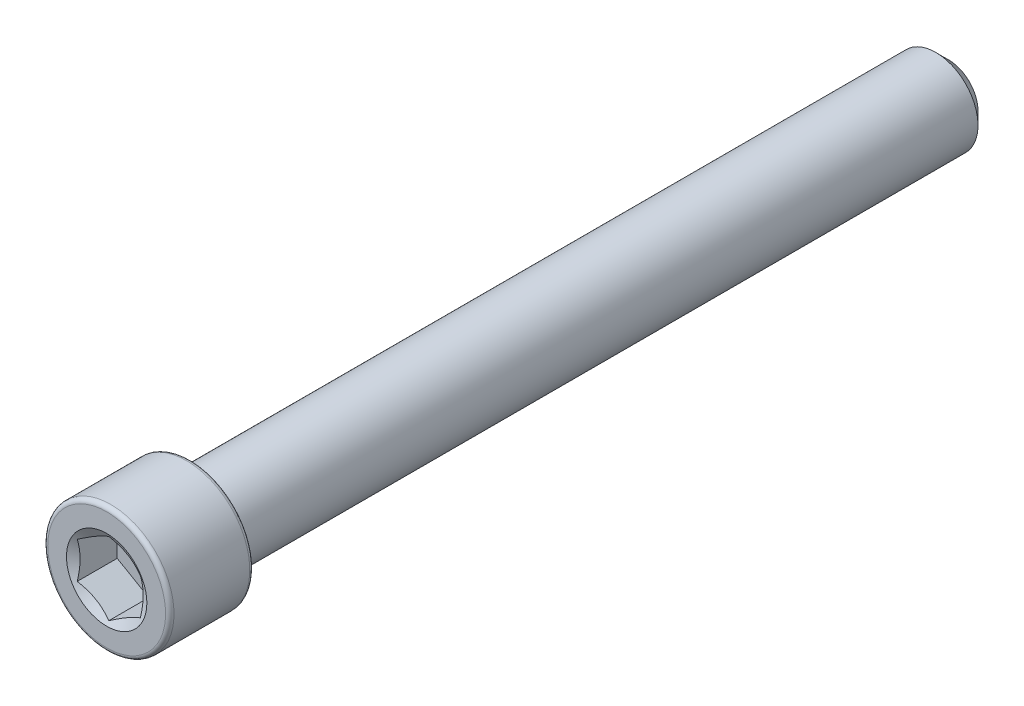
ISO-10303-21;
HEADER;
FILE_DESCRIPTION(('STEP AP214'),'2;1');
FILE_NAME('part.step','',(''),(''),'','','');
FILE_SCHEMA(('AUTOMOTIVE_DESIGN { 1 0 10303 214 1 1 1 1 }'));
ENDSEC;
DATA;
#1=APPLICATION_CONTEXT('core data for automotive mechanical design processes');
#2=APPLICATION_PROTOCOL_DEFINITION('international standard','automotive_design',2000,#1);
#3=PRODUCT_CONTEXT('',#1,'mechanical');
#4=PRODUCT('Part','Part','',(#3));
#5=PRODUCT_RELATED_PRODUCT_CATEGORY('part','',(#4));
#6=PRODUCT_DEFINITION_FORMATION('','',#4);
#7=PRODUCT_DEFINITION_CONTEXT('part definition',#1,'design');
#8=PRODUCT_DEFINITION('design','',#6,#7);
#9=PRODUCT_DEFINITION_SHAPE('','',#8);
#10=(LENGTH_UNIT() NAMED_UNIT(*) SI_UNIT(.MILLI.,.METRE.));
#11=(NAMED_UNIT(*) PLANE_ANGLE_UNIT() SI_UNIT($,.RADIAN.));
#12=(NAMED_UNIT(*) SI_UNIT($,.STERADIAN.) SOLID_ANGLE_UNIT());
#13=UNCERTAINTY_MEASURE_WITH_UNIT(LENGTH_MEASURE(1.E-05),#10,'distance_accuracy_value','');
#14=(GEOMETRIC_REPRESENTATION_CONTEXT(3) GLOBAL_UNCERTAINTY_ASSIGNED_CONTEXT((#13)) GLOBAL_UNIT_ASSIGNED_CONTEXT((#10,
#11,#12)) REPRESENTATION_CONTEXT('',''));
#15=CARTESIAN_POINT('',(0.,0.,0.));
#16=DIRECTION('',(0.,0.,1.));
#17=DIRECTION('',(1.,0.,0.));
#18=AXIS2_PLACEMENT_3D('',#15,#16,#17);
#19=CARTESIAN_POINT('',(0.,0.,-31.75));
#20=DIRECTION('',(0.,0.,-1.));
#21=DIRECTION('',(-1.,0.,0.));
#22=AXIS2_PLACEMENT_3D('',#19,#20,#21);
#23=PLANE('',#22);
#24=CARTESIAN_POINT('',(0.,0.,-31.75));
#25=DIRECTION('',(0.,0.,-1.));
#26=DIRECTION('',(-1.,0.,0.));
#27=AXIS2_PLACEMENT_3D('',#24,#25,#26);
#28=CIRCLE('',#27,2.22250000000002);
#29=CARTESIAN_POINT('',(-2.22250000000002,0.,-31.75));
#30=VERTEX_POINT('',#29);
#31=EDGE_CURVE('E48',#30,#30,#28,.T.);
#32=ORIENTED_EDGE('',*,*,#31,.T.);
#33=EDGE_LOOP('',(#32));
#34=FACE_BOUND('',#33,.T.);
#35=ADVANCED_FACE('F35',(#34),#23,.T.);
#36=CARTESIAN_POINT('',(0.,0.,-31.75));
#37=DIRECTION('',(0.,0.,1.));
#38=DIRECTION('',(1.,0.,0.));
#39=AXIS2_PLACEMENT_3D('',#36,#37,#38);
#40=CONICAL_SURFACE('',#39,2.22250000000002,0.785398163397449);
#41=CARTESIAN_POINT('',(0.,0.,-30.7975));
#42=DIRECTION('',(0.,0.,-1.));
#43=DIRECTION('',(-1.,0.,0.));
#44=AXIS2_PLACEMENT_3D('',#41,#42,#43);
#45=CIRCLE('',#44,3.17500000000002);
#46=CARTESIAN_POINT('',(-3.17500000000002,0.,-30.7975));
#47=VERTEX_POINT('',#46);
#48=EDGE_CURVE('E133',#47,#47,#45,.T.);
#49=ORIENTED_EDGE('',*,*,#48,.T.);
#50=EDGE_LOOP('',(#49));
#51=FACE_BOUND('',#50,.T.);
#52=ORIENTED_EDGE('',*,*,#31,.F.);
#53=EDGE_LOOP('',(#52));
#54=FACE_BOUND('',#53,.T.);
#55=ADVANCED_FACE('F139',(#51,#54),#40,.T.);
#56=CARTESIAN_POINT('',(0.,0.,-31.75));
#57=DIRECTION('',(0.,0.,-1.));
#58=DIRECTION('',(-1.,0.,0.));
#59=AXIS2_PLACEMENT_3D('',#56,#57,#58);
#60=CYLINDRICAL_SURFACE('',#59,3.17500000000002);
#61=CARTESIAN_POINT('',(0.,0.,25.4));
#62=DIRECTION('',(0.,0.,-1.));
#63=DIRECTION('',(-1.,0.,0.));
#64=AXIS2_PLACEMENT_3D('',#61,#62,#63);
#65=CIRCLE('',#64,3.17500000000002);
#66=CARTESIAN_POINT('',(-3.17500000000002,0.,25.4));
#67=VERTEX_POINT('',#66);
#68=EDGE_CURVE('E130',#67,#67,#65,.T.);
#69=ORIENTED_EDGE('',*,*,#68,.T.);
#70=EDGE_LOOP('',(#69));
#71=FACE_BOUND('',#70,.T.);
#72=ORIENTED_EDGE('',*,*,#48,.F.);
#73=EDGE_LOOP('',(#72));
#74=FACE_BOUND('',#73,.T.);
#75=ADVANCED_FACE('F141',(#71,#74),#60,.T.);
#76=CARTESIAN_POINT('',(0.,3.175,25.4));
#77=DIRECTION('',(0.,0.,-1.));
#78=DIRECTION('',(-1.,0.,0.));
#79=AXIS2_PLACEMENT_3D('',#76,#77,#78);
#80=PLANE('',#79);
#81=CARTESIAN_POINT('',(0.,0.,25.4));
#82=DIRECTION('',(0.,0.,-1.));
#83=DIRECTION('',(-1.,0.,0.));
#84=AXIS2_PLACEMENT_3D('',#81,#82,#83);
#85=CIRCLE('',#84,4.445);
#86=CARTESIAN_POINT('',(-4.445,0.,25.4));
#87=VERTEX_POINT('',#86);
#88=EDGE_CURVE('E127',#87,#87,#85,.T.);
#89=ORIENTED_EDGE('',*,*,#88,.T.);
#90=EDGE_LOOP('',(#89));
#91=FACE_BOUND('',#90,.T.);
#92=ORIENTED_EDGE('',*,*,#68,.F.);
#93=EDGE_LOOP('',(#92));
#94=FACE_BOUND('',#93,.T.);
#95=ADVANCED_FACE('F147',(#91,#94),#80,.T.);
#96=CARTESIAN_POINT('',(0.,0.,25.7175));
#97=DIRECTION('',(0.,0.,-1.));
#98=DIRECTION('',(-1.,0.,0.));
#99=AXIS2_PLACEMENT_3D('',#96,#97,#98);
#100=TOROIDAL_SURFACE('',#99,4.445,0.317499999999999);
#101=CARTESIAN_POINT('',(0.,0.,25.7175));
#102=DIRECTION('',(0.,0.,-1.));
#103=DIRECTION('',(-1.,0.,0.));
#104=AXIS2_PLACEMENT_3D('',#101,#102,#103);
#105=CIRCLE('',#104,4.7625);
#106=CARTESIAN_POINT('',(-4.7625,0.,25.7175));
#107=VERTEX_POINT('',#106);
#108=EDGE_CURVE('E124',#107,#107,#105,.T.);
#109=ORIENTED_EDGE('',*,*,#108,.T.);
#110=EDGE_LOOP('',(#109));
#111=FACE_BOUND('',#110,.T.);
#112=ORIENTED_EDGE('',*,*,#88,.F.);
#113=EDGE_LOOP('',(#112));
#114=FACE_BOUND('',#113,.T.);
#115=ADVANCED_FACE('F153',(#111,#114),#100,.T.);
#116=CARTESIAN_POINT('',(0.,0.,-31.75));
#117=DIRECTION('',(0.,0.,-1.));
#118=DIRECTION('',(-1.,0.,0.));
#119=AXIS2_PLACEMENT_3D('',#116,#117,#118);
#120=CYLINDRICAL_SURFACE('',#119,4.7625);
#121=CARTESIAN_POINT('',(0.,0.,31.4325));
#122=DIRECTION('',(0.,0.,-1.));
#123=DIRECTION('',(-1.,0.,0.));
#124=AXIS2_PLACEMENT_3D('',#121,#122,#123);
#125=CIRCLE('',#124,4.7625);
#126=CARTESIAN_POINT('',(-4.7625,0.,31.4325));
#127=VERTEX_POINT('',#126);
#128=EDGE_CURVE('E121',#127,#127,#125,.T.);
#129=ORIENTED_EDGE('',*,*,#128,.T.);
#130=EDGE_LOOP('',(#129));
#131=FACE_BOUND('',#130,.T.);
#132=ORIENTED_EDGE('',*,*,#108,.F.);
#133=EDGE_LOOP('',(#132));
#134=FACE_BOUND('',#133,.T.);
#135=ADVANCED_FACE('F157',(#131,#134),#120,.T.);
#136=CARTESIAN_POINT('',(0.,0.,31.4325));
#137=DIRECTION('',(0.,0.,-1.));
#138=DIRECTION('',(-1.,0.,0.));
#139=AXIS2_PLACEMENT_3D('',#136,#137,#138);
#140=TOROIDAL_SURFACE('',#139,4.445,0.317499999999999);
#141=CARTESIAN_POINT('',(0.,0.,31.75));
#142=DIRECTION('',(0.,0.,-1.));
#143=DIRECTION('',(-1.,0.,0.));
#144=AXIS2_PLACEMENT_3D('',#141,#142,#143);
#145=CIRCLE('',#144,4.445);
#146=CARTESIAN_POINT('',(-4.445,0.,31.75));
#147=VERTEX_POINT('',#146);
#148=EDGE_CURVE('E118',#147,#147,#145,.T.);
#149=ORIENTED_EDGE('',*,*,#148,.T.);
#150=EDGE_LOOP('',(#149));
#151=FACE_BOUND('',#150,.T.);
#152=ORIENTED_EDGE('',*,*,#128,.F.);
#153=EDGE_LOOP('',(#152));
#154=FACE_BOUND('',#153,.T.);
#155=ADVANCED_FACE('F161',(#151,#154),#140,.T.);
#156=CARTESIAN_POINT('',(0.,4.44499999999999,31.75));
#157=DIRECTION('',(0.,0.,1.));
#158=DIRECTION('',(1.,0.,0.));
#159=AXIS2_PLACEMENT_3D('',#156,#157,#158);
#160=PLANE('',#159);
#161=CARTESIAN_POINT('',(0.,0.,31.75));
#162=DIRECTION('',(0.,0.,1.));
#163=DIRECTION('',(1.,0.,0.));
#164=AXIS2_PLACEMENT_3D('',#161,#162,#163);
#165=CIRCLE('',#164,3.03219221417965);
#166=CARTESIAN_POINT('',(3.03219221417965,0.,31.75));
#167=VERTEX_POINT('',#166);
#168=EDGE_CURVE('E255',#167,#167,#165,.T.);
#169=ORIENTED_EDGE('',*,*,#168,.F.);
#170=EDGE_LOOP('',(#169));
#171=FACE_BOUND('',#170,.T.);
#172=ORIENTED_EDGE('',*,*,#148,.F.);
#173=EDGE_LOOP('',(#172));
#174=FACE_BOUND('',#173,.T.);
#175=ADVANCED_FACE('F165',(#171,#174),#160,.T.);
#176=CARTESIAN_POINT('',(0.,0.,31.75));
#177=DIRECTION('',(0.,0.,1.));
#178=DIRECTION('',(1.,0.,0.));
#179=AXIS2_PLACEMENT_3D('',#176,#177,#178);
#180=CONICAL_SURFACE('',#179,3.03219221417965,1.0471975511966);
#181=ORIENTED_EDGE('',*,*,#168,.T.);
#182=EDGE_LOOP('',(#181));
#183=FACE_BOUND('',#182,.T.);
#184=CARTESIAN_POINT('',(2.38144999999999,1.37469985845395,31.5869296797747));
#185=CARTESIAN_POINT('',(2.27680510857801,1.43511661468575,31.5520335875339));
#186=CARTESIAN_POINT('',(2.1712569313955,1.49605488319455,31.5202965816836));
#187=CARTESIAN_POINT('',(1.95833280582788,1.61898668440797,31.4648986717318));
#188=CARTESIAN_POINT('',(1.85095307338657,1.68098240183847,31.4412573664923));
#189=CARTESIAN_POINT('',(1.63752441306378,1.80420549632862,31.4044553443056));
#190=CARTESIAN_POINT('',(1.53150832846242,1.86541391131164,31.3910497054727));
#191=CARTESIAN_POINT('',(1.31897718209788,1.98811882587639,31.3750446234132));
#192=CARTESIAN_POINT('',(1.21246289310218,2.0496148793006,31.3724319282234));
#193=CARTESIAN_POINT('',(1.01342600969027,2.16452887751713,31.3778600893658));
#194=CARTESIAN_POINT('',(0.920873657438133,2.21796400300404,31.3845681458576));
#195=CARTESIAN_POINT('',(0.73637194615315,2.32448611568037,31.4058309696217));
#196=CARTESIAN_POINT('',(0.644423225529251,2.37757273428422,31.4203930040322));
#197=CARTESIAN_POINT('',(0.459540942889933,2.48431456993442,31.4567978377253));
#198=CARTESIAN_POINT('',(0.366630787034619,2.53795627342794,31.4787949938814));
#199=CARTESIAN_POINT('',(0.182196405744559,2.64443951311357,31.5287202236105));
#200=CARTESIAN_POINT('',(0.0906698164537926,2.69728241407861,31.5566365624169));
#201=CARTESIAN_POINT('',(-0.000200000000002036,2.74974612706942,31.5869296797747));
#202=B_SPLINE_CURVE_WITH_KNOTS('',3,(#184,#185,#186,#187,#188,#189,#190,#191,#192,#193,#194,
#195,#196,#197,#198,#199,#200,#201),.UNSPECIFIED.,.F.,.F.,(4,2,2,2,2,2,2,2,4),(0.,
0.377463001720438,0.755833447356083,1.1248388545394,1.49339104874266,1.81432726847353,
2.13556095518869,2.4639212191382,2.791636496483),.UNSPECIFIED.);
#203=CARTESIAN_POINT('',(2.38124999999999,1.37481532850779,31.5868630089087));
#204=VERTEX_POINT('',#203);
#205=CARTESIAN_POINT('',(0.,2.74963065701558,31.5868630089087));
#206=VERTEX_POINT('',#205);
#207=EDGE_CURVE('E102',#204,#206,#202,.T.);
#208=ORIENTED_EDGE('',*,*,#207,.F.);
#209=CARTESIAN_POINT('',(2.38124999999999,-3.59976633824536,32.4912611644295));
#210=CARTESIAN_POINT('',(2.38124999999999,-3.49646395881335,32.4415324836855));
#211=CARTESIAN_POINT('',(2.38124999999999,-3.39291407009264,32.3923085892494));
#212=CARTESIAN_POINT('',(2.38124999999999,-3.18518717181845,32.2951564977165));
#213=CARTESIAN_POINT('',(2.38124999999999,-3.08101005703531,32.2472285258865));
#214=CARTESIAN_POINT('',(2.38124999999999,-2.87131401421192,32.1526930902144));
#215=CARTESIAN_POINT('',(2.38124999999999,-2.76579079437245,32.1060951113206));
#216=CARTESIAN_POINT('',(2.38124999999999,-2.55387118203946,32.0149364827971));
#217=CARTESIAN_POINT('',(2.38124999999999,-2.44747483422771,31.9703757296712));
#218=CARTESIAN_POINT('',(2.38124999999999,-2.23067196845909,31.882631851781));
#219=CARTESIAN_POINT('',(2.38124999999999,-2.12023600195453,31.8395210708127));
#220=CARTESIAN_POINT('',(2.38124999999999,-1.89803839134692,31.7567937390092));
#221=CARTESIAN_POINT('',(2.38124999999999,-1.78627659559216,31.7171775923576));
#222=CARTESIAN_POINT('',(2.38124999999999,-1.56149041735538,31.6425477895721));
#223=CARTESIAN_POINT('',(2.38124999999999,-1.4484694476167,31.6075239630361));
#224=CARTESIAN_POINT('',(2.38124999999999,-1.22081073511454,31.5432629117452));
#225=CARTESIAN_POINT('',(2.38124999999999,-1.10617354309387,31.5140237645329));
#226=CARTESIAN_POINT('',(2.38124999999999,-0.87579075687879,31.4629337388859));
#227=CARTESIAN_POINT('',(2.38124999999999,-0.760052762621302,31.4410492449066));
#228=CARTESIAN_POINT('',(2.38124999999999,-0.527241538813736,31.4059822843521));
#229=CARTESIAN_POINT('',(2.38124999999999,-0.410168413785966,31.3927991412743));
#230=CARTESIAN_POINT('',(2.38124999999999,-0.176757909156527,31.3763592365983));
#231=CARTESIAN_POINT('',(2.38124999999999,-0.0604292020566085,31.3729823294229));
#232=CARTESIAN_POINT('',(2.38124999999999,0.172102526495439,31.3761301571011));
#233=CARTESIAN_POINT('',(2.38124999999999,0.288305540624632,31.3826554407246));
#234=CARTESIAN_POINT('',(2.38124999999999,0.488407104907262,31.4019728989663));
#235=CARTESIAN_POINT('',(2.38124999999999,0.572526768128157,31.4125877365416));
#236=CARTESIAN_POINT('',(2.38124999999999,0.74008592875166,31.4382929254538));
#237=CARTESIAN_POINT('',(2.38124999999999,0.8235253196623,31.4533839641938));
#238=CARTESIAN_POINT('',(2.38124999999999,1.07273325586547,31.50457343129));
#239=CARTESIAN_POINT('',(2.38124999999999,1.23729002677746,31.5465771837148));
#240=CARTESIAN_POINT('',(2.38124999999999,1.56668315583935,31.6429511253518));
#241=CARTESIAN_POINT('',(2.38124999999999,1.73144052822359,31.6975811694067));
#242=CARTESIAN_POINT('',(2.38124999999999,1.97631292230748,31.7856187750601));
#243=CARTESIAN_POINT('',(2.38124999999999,2.05754928439702,31.8159756920629));
#244=CARTESIAN_POINT('',(2.38124999999999,2.21936297141559,31.8783957224258));
#245=CARTESIAN_POINT('',(2.38124999999999,2.29994030817706,31.9104588050747));
#246=CARTESIAN_POINT('',(2.38124999999999,2.5091120281204,31.9958324530248));
#247=CARTESIAN_POINT('',(2.38124999999999,2.63725060996072,32.05025731756));
#248=CARTESIAN_POINT('',(2.38124999999999,2.89233256605393,32.1618480388214));
#249=CARTESIAN_POINT('',(2.38124999999999,3.01927584315839,32.2190141160782));
#250=CARTESIAN_POINT('',(2.38124999999999,3.27222855247939,32.3354567661809));
#251=CARTESIAN_POINT('',(2.38124999999999,3.39823772867163,32.3947338935472));
#252=CARTESIAN_POINT('',(2.38124999999999,3.64947609912466,32.5149213116136));
#253=CARTESIAN_POINT('',(2.38124999999999,3.77470527471068,32.575831641232));
#254=CARTESIAN_POINT('',(2.38124999999999,4.14976436460612,32.7606293734581));
#255=CARTESIAN_POINT('',(2.38124999999999,4.39864815512714,32.8864349728279));
#256=CARTESIAN_POINT('',(2.38124999999999,4.89467625611778,33.1413121050035));
#257=CARTESIAN_POINT('',(2.38124999999999,5.14182083564056,33.2703831177985));
#258=CARTESIAN_POINT('',(2.38124999999999,5.61084172457359,33.518066970761));
#259=CARTESIAN_POINT('',(2.38124999999999,5.83282885020018,33.6364703062649));
#260=CARTESIAN_POINT('',(2.38124999999999,6.27608857926104,33.8746296719868));
#261=CARTESIAN_POINT('',(2.38124999999999,6.49736114870037,33.9943857653776));
#262=CARTESIAN_POINT('',(2.38124999999999,6.93875603869057,34.2345822776972));
#263=CARTESIAN_POINT('',(2.38124999999999,7.15887985119654,34.3550199580106));
#264=CARTESIAN_POINT('',(2.38124999999999,7.59868091402183,34.596675883145));
#265=CARTESIAN_POINT('',(2.38124999999999,7.81835819130602,34.7178940788725));
#266=CARTESIAN_POINT('',(2.38124999999999,8.03787642276087,34.8393977522439));
#267=B_SPLINE_CURVE_WITH_KNOTS('',3,(#209,#210,#211,#212,#213,#214,#215,#216,#217,#218,#219,
#220,#221,#222,#223,#224,#225,#226,#227,#228,#229,#230,#231,#232,#233,#234,#235,#236,#237,#238,
#239,#240,#241,#242,#243,#244,#245,#246,#247,#248,#249,#250,#251,#252,#253,#254,#255,#256,#257,
#258,#259,#260,#261,#262,#263,#264,#265,#266),.UNSPECIFIED.,.F.,.F.,(4,2,2,2,2,2,2,2,2,2,2,2,2,
2,2,2,2,2,2,2,2,2,2,2,2,2,2,2,4),(0.,0.343950780921492,0.687960970461106,1.03400548394369,
1.38003239789182,1.73564357991987,2.09129583755096,2.44614664320016,2.80087932031081,
3.15396785782398,3.50702894058493,3.8557456967058,4.20448177908074,4.45871798756717,
4.71299325892998,5.22184880640698,5.74229337432344,6.00244751925213,6.26259698295639,
6.68020411231571,7.09784489471857,7.51559620207538,7.93335747307521,8.76993188334094,
9.60637389902891,10.3611381643167,11.1159378234817,11.8686893766333,12.6213940361871),.UNSPECIFIED.);
#268=CARTESIAN_POINT('',(2.38124999999999,-1.37481532850779,31.5868630089087));
#269=VERTEX_POINT('',#268);
#270=EDGE_CURVE('E211',#269,#204,#267,.T.);
#271=ORIENTED_EDGE('',*,*,#270,.F.);
#272=CARTESIAN_POINT('',(-0.000200000000000813,-2.74974612706942,31.5869296797747));
#273=CARTESIAN_POINT('',(0.104444891421974,-2.68932937083762,31.5520335875339));
#274=CARTESIAN_POINT('',(0.209993068604493,-2.62839110232882,31.5202965816836));
#275=CARTESIAN_POINT('',(0.422917194172107,-2.50545930111539,31.4648986717318));
#276=CARTESIAN_POINT('',(0.530296926613415,-2.44346358368489,31.4412573664923));
#277=CARTESIAN_POINT('',(0.74372558693621,-2.32024048919475,31.4044553443056));
#278=CARTESIAN_POINT('',(0.849741671537563,-2.25903207421172,31.3910497054727));
#279=CARTESIAN_POINT('',(1.06227281790211,-2.13632715964697,31.3750446234132));
#280=CARTESIAN_POINT('',(1.16878710689781,-2.07483110622276,31.3724319282234));
#281=CARTESIAN_POINT('',(1.36782399030972,-1.95991710800624,31.3778600893658));
#282=CARTESIAN_POINT('',(1.46037634256186,-1.90648198251933,31.3845681458576));
#283=CARTESIAN_POINT('',(1.64487805384684,-1.799959869843,31.4058309696217));
#284=CARTESIAN_POINT('',(1.73682677447074,-1.74687325123915,31.4203930040322));
#285=CARTESIAN_POINT('',(1.92170905711005,-1.64013141558895,31.4567978377253));
#286=CARTESIAN_POINT('',(2.01461921296537,-1.58648971209543,31.4787949938814));
#287=CARTESIAN_POINT('',(2.19905359425543,-1.48000647240979,31.5287202236105));
#288=CARTESIAN_POINT('',(2.29058018354619,-1.42716357144476,31.5566365624169));
#289=CARTESIAN_POINT('',(2.38144999999999,-1.37469985845395,31.5869296797747));
#290=B_SPLINE_CURVE_WITH_KNOTS('',3,(#272,#273,#274,#275,#276,#277,#278,#279,#280,#281,#282,
#283,#284,#285,#286,#287,#288,#289),.UNSPECIFIED.,.F.,.F.,(4,2,2,2,2,2,2,2,4),(0.,
0.377463001720439,0.755833447356084,1.1248388545394,1.49339104874266,1.81432726847353,
2.13556095518869,2.4639212191382,2.791636496483),.UNSPECIFIED.);
#291=CARTESIAN_POINT('',(0.,-2.74963065701558,31.5868630089087));
#292=VERTEX_POINT('',#291);
#293=EDGE_CURVE('E205',#292,#269,#290,.T.);
#294=ORIENTED_EDGE('',*,*,#293,.F.);
#295=CARTESIAN_POINT('',(-2.38144999999999,-1.37469985845395,31.5869296797747));
#296=CARTESIAN_POINT('',(-2.27680510857801,-1.43511661468575,31.5520335875339));
#297=CARTESIAN_POINT('',(-2.17125693139549,-1.49605488319455,31.5202965816836));
#298=CARTESIAN_POINT('',(-1.95833280582788,-1.61898668440798,31.4648986717318));
#299=CARTESIAN_POINT('',(-1.85095307338657,-1.68098240183848,31.4412573664923));
#300=CARTESIAN_POINT('',(-1.63752441306378,-1.80420549632862,31.4044553443056));
#301=CARTESIAN_POINT('',(-1.53150832846242,-1.86541391131165,31.3910497054727));
#302=CARTESIAN_POINT('',(-1.31897718209788,-1.9881188258764,31.3750446234132));
#303=CARTESIAN_POINT('',(-1.21246289310218,-2.04961487930061,31.3724319282234));
#304=CARTESIAN_POINT('',(-1.01342600969027,-2.16452887751713,31.3778600893658));
#305=CARTESIAN_POINT('',(-0.920873657438133,-2.21796400300404,31.3845681458576));
#306=CARTESIAN_POINT('',(-0.736371946153151,-2.32448611568037,31.4058309696217));
#307=CARTESIAN_POINT('',(-0.644423225529251,-2.37757273428422,31.4203930040322));
#308=CARTESIAN_POINT('',(-0.459540942889935,-2.48431456993442,31.4567978377253));
#309=CARTESIAN_POINT('',(-0.366630787034621,-2.53795627342794,31.4787949938814));
#310=CARTESIAN_POINT('',(-0.182196405744562,-2.64443951311358,31.5287202236105));
#311=CARTESIAN_POINT('',(-0.0906698164537956,-2.69728241407861,31.5566365624169));
#312=CARTESIAN_POINT('',(0.000199999999998992,-2.74974612706942,31.5869296797747));
#313=B_SPLINE_CURVE_WITH_KNOTS('',3,(#295,#296,#297,#298,#299,#300,#301,#302,#303,#304,#305,
#306,#307,#308,#309,#310,#311,#312),.UNSPECIFIED.,.F.,.F.,(4,2,2,2,2,2,2,2,4),(0.,
0.377463001720437,0.755833447356084,1.1248388545394,1.49339104874266,1.81432726847353,
2.13556095518869,2.46392121913819,2.79163649648299),.UNSPECIFIED.);
#314=CARTESIAN_POINT('',(-2.38124999999999,-1.37481532850779,31.5868630089087));
#315=VERTEX_POINT('',#314);
#316=EDGE_CURVE('E55',#315,#292,#313,.T.);
#317=ORIENTED_EDGE('',*,*,#316,.F.);
#318=CARTESIAN_POINT('',(-2.38124999999999,-3.59976633839615,32.4912611645021));
#319=CARTESIAN_POINT('',(-2.38124999999999,-3.49646395895908,32.4415324837551));
#320=CARTESIAN_POINT('',(-2.38124999999999,-3.3929140702333,32.3923085893159));
#321=CARTESIAN_POINT('',(-2.38124999999999,-3.18518717194897,32.2951564977768));
#322=CARTESIAN_POINT('',(-2.38124999999999,-3.08101005716076,32.2472285259438));
#323=CARTESIAN_POINT('',(-2.38124999999999,-2.87131401432711,32.1526930902656));
#324=CARTESIAN_POINT('',(-2.38124999999999,-2.76579079448248,32.1060951113687));
#325=CARTESIAN_POINT('',(-2.38124999999999,-2.55387118213911,32.0149364828392));
#326=CARTESIAN_POINT('',(-2.38124999999999,-2.44747483432216,31.9703757297102));
#327=CARTESIAN_POINT('',(-2.38124999999999,-2.23067196854282,31.882631851814));
#328=CARTESIAN_POINT('',(-2.38124999999999,-2.12023600203275,31.8395210708426));
#329=CARTESIAN_POINT('',(-2.38124999999999,-1.89803839141401,31.7567937390333));
#330=CARTESIAN_POINT('',(-2.38124999999999,-1.78627659565364,31.7171775923788));
#331=CARTESIAN_POINT('',(-2.38124999999999,-1.56149041740554,31.6425477895879));
#332=CARTESIAN_POINT('',(-2.38124999999999,-1.44846944766115,31.6075239630494));
#333=CARTESIAN_POINT('',(-2.38124999999999,-1.22081073514739,31.5432629117538));
#334=CARTESIAN_POINT('',(-2.38124999999999,-1.10617354312085,31.5140237645394));
#335=CARTESIAN_POINT('',(-2.38124999999999,-0.875790756890795,31.4629337388881));
#336=CARTESIAN_POINT('',(-2.38124999999999,-0.760052762624166,31.4410492449069));
#337=CARTESIAN_POINT('',(-2.38124999999999,-0.52724153879812,31.4059822843499));
#338=CARTESIAN_POINT('',(-2.38124999999999,-0.41016841376101,31.3927991412715));
#339=CARTESIAN_POINT('',(-2.38124999999999,-0.176757909113057,31.3763592365962));
#340=CARTESIAN_POINT('',(-2.38124999999999,-0.0604292020039645,31.3729823294219));
#341=CARTESIAN_POINT('',(-2.38124999999999,0.172102526566265,31.3761301571037));
#342=CARTESIAN_POINT('',(-2.38124999999999,0.288305540704466,31.3826554407299));
#343=CARTESIAN_POINT('',(-2.38124999999999,0.488407104998749,31.4019728989769));
#344=CARTESIAN_POINT('',(-2.38124999999999,0.572526768222386,31.4125877365543));
#345=CARTESIAN_POINT('',(-2.38124999999999,0.740085928851259,31.4382929254708));
#346=CARTESIAN_POINT('',(-2.38124999999999,0.823525319764528,31.4533839642131));
#347=CARTESIAN_POINT('',(-2.38124999999999,1.07273325597546,31.5045734313161));
#348=CARTESIAN_POINT('',(-2.38124999999999,1.23729002689244,31.5465771837454));
#349=CARTESIAN_POINT('',(-2.38124999999999,1.56668315596438,31.6429511253914));
#350=CARTESIAN_POINT('',(-2.38124999999999,1.73144052835366,31.6975811694509));
#351=CARTESIAN_POINT('',(-2.38124999999999,1.97631292244508,31.7856187751109));
#352=CARTESIAN_POINT('',(-2.38124999999999,2.05754928453712,31.8159756921158));
#353=CARTESIAN_POINT('',(-2.38124999999999,2.2193629715607,31.878395722483));
#354=CARTESIAN_POINT('',(-2.38124999999999,2.29994030832468,31.9104588051339));
#355=CARTESIAN_POINT('',(-2.38124999999999,2.50911202826962,31.9958324530874));
#356=CARTESIAN_POINT('',(-2.38124999999999,2.63725061010909,32.0502573176237));
#357=CARTESIAN_POINT('',(-2.38124999999999,2.89233256620073,32.1618480388869));
#358=CARTESIAN_POINT('',(-2.38124999999999,3.01927584330446,32.2190141161445));
#359=CARTESIAN_POINT('',(-2.38124999999999,3.27222855262406,32.3354567662485));
#360=CARTESIAN_POINT('',(-2.38124999999999,3.39823772881564,32.3947338936153));
#361=CARTESIAN_POINT('',(-2.38124999999999,3.64947609926741,32.5149213116827));
#362=CARTESIAN_POINT('',(-2.38124999999999,3.77470527485284,32.5758316413015));
#363=CARTESIAN_POINT('',(-2.38124999999999,4.14976436474653,32.7606293735285));
#364=CARTESIAN_POINT('',(-2.38124999999999,4.39864815526647,32.8864349728987));
#365=CARTESIAN_POINT('',(-2.38124999999999,4.89467625625507,33.1413121050749));
#366=CARTESIAN_POINT('',(-2.38124999999999,5.14182083577689,33.27038311787));
#367=CARTESIAN_POINT('',(-2.38124999999999,5.61084172470906,33.518066970833));
#368=CARTESIAN_POINT('',(-2.38124999999999,5.83282885033574,33.6364703063374));
#369=CARTESIAN_POINT('',(-2.38124999999999,6.27608857939679,33.8746296720601));
#370=CARTESIAN_POINT('',(-2.38124999999998,6.49736114883624,33.9943857654512));
#371=CARTESIAN_POINT('',(-2.38124999999998,6.93875603882681,34.2345822777717));
#372=CARTESIAN_POINT('',(-2.38124999999998,7.15887985133303,34.3550199580853));
#373=CARTESIAN_POINT('',(-2.38124999999998,7.59868091415885,34.5966758832205));
#374=CARTESIAN_POINT('',(-2.38124999999998,7.81835819144332,34.7178940789483));
#375=CARTESIAN_POINT('',(-2.38124999999998,8.03787642289845,34.83939775232));
#376=B_SPLINE_CURVE_WITH_KNOTS('',3,(#318,#319,#320,#321,#322,#323,#324,#325,#326,#327,#328,
#329,#330,#331,#332,#333,#334,#335,#336,#337,#338,#339,#340,#341,#342,#343,#344,#345,#346,#347,
#348,#349,#350,#351,#352,#353,#354,#355,#356,#357,#358,#359,#360,#361,#362,#363,#364,#365,#366,
#367,#368,#369,#370,#371,#372,#373,#374,#375),.UNSPECIFIED.,.F.,.F.,(4,2,2,2,2,2,2,2,2,2,2,2,2,
2,2,2,2,2,2,2,2,2,2,2,2,2,2,2,4),(0.,0.343950780939161,0.687960970496447,1.03400548399693,
1.38003239796294,1.73564358000971,2.09129583765952,2.44614664332736,2.80087932045664,
3.15396785799777,3.50702894078664,3.85574569693483,4.2044817793371,4.45871798783248,
4.71299325920425,5.22184880669918,5.74229337463427,6.00244751957226,6.26259698328581,
6.68020411264408,7.09784489504589,7.51559620240161,7.93335747340035,8.76993188366371,
9.60637389934934,10.361138164638,11.1159378238038,11.8686893769566,12.6213940365117),.UNSPECIFIED.);
#377=CARTESIAN_POINT('',(-2.38124999999999,1.37481532850779,31.5868630089087));
#378=VERTEX_POINT('',#377);
#379=EDGE_CURVE('E11',#378,#315,#376,.F.);
#380=ORIENTED_EDGE('',*,*,#379,.F.);
#381=CARTESIAN_POINT('',(0.000199999999998605,2.74974612706942,31.5869296797747));
#382=CARTESIAN_POINT('',(-0.104444891421976,2.68932937083762,31.5520335875339));
#383=CARTESIAN_POINT('',(-0.209993068604495,2.62839110232882,31.5202965816836));
#384=CARTESIAN_POINT('',(-0.422917194172109,2.50545930111539,31.4648986717318));
#385=CARTESIAN_POINT('',(-0.530296926613417,2.44346358368489,31.4412573664923));
#386=CARTESIAN_POINT('',(-0.743725586936212,2.32024048919474,31.4044553443056));
#387=CARTESIAN_POINT('',(-0.849741671537565,2.25903207421172,31.3910497054727));
#388=CARTESIAN_POINT('',(-1.06227281790211,2.13632715964697,31.3750446234132));
#389=CARTESIAN_POINT('',(-1.16878710689781,2.07483110622276,31.3724319282234));
#390=CARTESIAN_POINT('',(-1.36782399030972,1.95991710800623,31.3778600893658));
#391=CARTESIAN_POINT('',(-1.46037634256186,1.90648198251933,31.3845681458576));
#392=CARTESIAN_POINT('',(-1.64487805384684,1.799959869843,31.4058309696217));
#393=CARTESIAN_POINT('',(-1.73682677447074,1.74687325123915,31.4203930040322));
#394=CARTESIAN_POINT('',(-1.92170905711005,1.64013141558895,31.4567978377253));
#395=CARTESIAN_POINT('',(-2.01461921296537,1.58648971209543,31.4787949938814));
#396=CARTESIAN_POINT('',(-2.19905359425543,1.48000647240979,31.5287202236105));
#397=CARTESIAN_POINT('',(-2.29058018354619,1.42716357144476,31.5566365624169));
#398=CARTESIAN_POINT('',(-2.38144999999999,1.37469985845395,31.5869296797747));
#399=B_SPLINE_CURVE_WITH_KNOTS('',3,(#381,#382,#383,#384,#385,#386,#387,#388,#389,#390,#391,
#392,#393,#394,#395,#396,#397,#398),.UNSPECIFIED.,.F.,.F.,(4,2,2,2,2,2,2,2,4),(0.,
0.377463001720438,0.755833447356083,1.1248388545394,1.49339104874266,1.81432726847353,
2.13556095518869,2.46392121913819,2.79163649648299),.UNSPECIFIED.);
#400=EDGE_CURVE('E93',#206,#378,#399,.T.);
#401=ORIENTED_EDGE('',*,*,#400,.F.);
#402=EDGE_LOOP('',(#208,#271,#294,#317,#380,#401));
#403=FACE_BOUND('',#402,.T.);
#404=ADVANCED_FACE('F92',(#183,#403),#180,.F.);
#405=CARTESIAN_POINT('',(0.,0.,28.575));
#406=DIRECTION('',(0.,0.,1.));
#407=DIRECTION('',(1.,0.,0.));
#408=AXIS2_PLACEMENT_3D('',#405,#406,#407);
#409=PLANE('',#408);
#410=DIRECTION('',(-0.866025403784439,-0.5,0.));
#411=VECTOR('',#410,1.);
#412=CARTESIAN_POINT('',(0.,2.74963065701558,28.575));
#413=LINE('',#412,#411);
#414=CARTESIAN_POINT('',(0.,2.74963065701558,28.575));
#415=VERTEX_POINT('',#414);
#416=CARTESIAN_POINT('',(-2.38124999999999,1.37481532850779,28.575));
#417=VERTEX_POINT('',#416);
#418=EDGE_CURVE('E101',#415,#417,#413,.T.);
#419=ORIENTED_EDGE('',*,*,#418,.T.);
#420=DIRECTION('',(0.,-1.,0.));
#421=VECTOR('',#420,1.);
#422=CARTESIAN_POINT('',(-2.38124999999999,1.37481532850779,28.575));
#423=LINE('',#422,#421);
#424=CARTESIAN_POINT('',(-2.38124999999999,-1.37481532850779,28.575));
#425=VERTEX_POINT('',#424);
#426=EDGE_CURVE('E106',#417,#425,#423,.T.);
#427=ORIENTED_EDGE('',*,*,#426,.T.);
#428=DIRECTION('',(0.866025403784439,-0.5,0.));
#429=VECTOR('',#428,1.);
#430=CARTESIAN_POINT('',(-2.38124999999999,-1.37481532850779,28.575));
#431=LINE('',#430,#429);
#432=CARTESIAN_POINT('',(0.,-2.74963065701558,28.575));
#433=VERTEX_POINT('',#432);
#434=EDGE_CURVE('E237',#425,#433,#431,.T.);
#435=ORIENTED_EDGE('',*,*,#434,.T.);
#436=DIRECTION('',(0.866025403784439,0.5,0.));
#437=VECTOR('',#436,1.);
#438=CARTESIAN_POINT('',(0.,-2.74963065701558,28.575));
#439=LINE('',#438,#437);
#440=CARTESIAN_POINT('',(2.38124999999999,-1.37481532850779,28.575));
#441=VERTEX_POINT('',#440);
#442=EDGE_CURVE('E241',#433,#441,#439,.T.);
#443=ORIENTED_EDGE('',*,*,#442,.T.);
#444=DIRECTION('',(0.,1.,0.));
#445=VECTOR('',#444,1.);
#446=CARTESIAN_POINT('',(2.38124999999999,-1.37481532850779,28.575));
#447=LINE('',#446,#445);
#448=CARTESIAN_POINT('',(2.38124999999999,1.37481532850779,28.575));
#449=VERTEX_POINT('',#448);
#450=EDGE_CURVE('E114',#441,#449,#447,.T.);
#451=ORIENTED_EDGE('',*,*,#450,.T.);
#452=DIRECTION('',(-0.866025403784439,0.5,0.));
#453=VECTOR('',#452,1.);
#454=CARTESIAN_POINT('',(2.38124999999999,1.37481532850779,28.575));
#455=LINE('',#454,#453);
#456=EDGE_CURVE('E109',#449,#415,#455,.T.);
#457=ORIENTED_EDGE('',*,*,#456,.T.);
#458=EDGE_LOOP('',(#419,#427,#435,#443,#451,#457));
#459=FACE_BOUND('',#458,.T.);
#460=ADVANCED_FACE('F191',(#459),#409,.T.);
#461=CARTESIAN_POINT('',(-2.38124999999999,1.37481532850779,28.575));
#462=DIRECTION('',(-1.,0.,0.));
#463=DIRECTION('',(0.,-1.,0.));
#464=AXIS2_PLACEMENT_3D('',#461,#462,#463);
#465=PLANE('',#464);
#466=DIRECTION('',(0.,0.,1.));
#467=VECTOR('',#466,1.);
#468=CARTESIAN_POINT('',(-2.38124999999999,1.37481532850779,28.575));
#469=LINE('',#468,#467);
#470=EDGE_CURVE('E99',#417,#378,#469,.T.);
#471=ORIENTED_EDGE('',*,*,#470,.T.);
#472=ORIENTED_EDGE('',*,*,#379,.T.);
#473=DIRECTION('',(0.,0.,1.));
#474=VECTOR('',#473,1.);
#475=CARTESIAN_POINT('',(-2.38124999999999,-1.37481532850779,28.575));
#476=LINE('',#475,#474);
#477=EDGE_CURVE('E108',#425,#315,#476,.T.);
#478=ORIENTED_EDGE('',*,*,#477,.F.);
#479=ORIENTED_EDGE('',*,*,#426,.F.);
#480=EDGE_LOOP('',(#471,#472,#478,#479));
#481=FACE_BOUND('',#480,.T.);
#482=ADVANCED_FACE('F104',(#481),#465,.F.);
#483=CARTESIAN_POINT('',(-2.38124999999999,-1.37481532850779,28.575));
#484=DIRECTION('',(-0.5,-0.866025403784439,0.));
#485=DIRECTION('',(0.866025403784439,-0.5,0.));
#486=AXIS2_PLACEMENT_3D('',#483,#484,#485);
#487=PLANE('',#486);
#488=ORIENTED_EDGE('',*,*,#477,.T.);
#489=ORIENTED_EDGE('',*,*,#316,.T.);
#490=DIRECTION('',(0.,0.,1.));
#491=VECTOR('',#490,1.);
#492=CARTESIAN_POINT('',(0.,-2.74963065701558,28.575));
#493=LINE('',#492,#491);
#494=EDGE_CURVE('E111',#433,#292,#493,.T.);
#495=ORIENTED_EDGE('',*,*,#494,.F.);
#496=ORIENTED_EDGE('',*,*,#434,.F.);
#497=EDGE_LOOP('',(#488,#489,#495,#496));
#498=FACE_BOUND('',#497,.T.);
#499=ADVANCED_FACE('F226',(#498),#487,.F.);
#500=CARTESIAN_POINT('',(0.,-2.74963065701558,28.575));
#501=DIRECTION('',(0.5,-0.866025403784439,0.));
#502=DIRECTION('',(0.866025403784439,0.5,0.));
#503=AXIS2_PLACEMENT_3D('',#500,#501,#502);
#504=PLANE('',#503);
#505=ORIENTED_EDGE('',*,*,#494,.T.);
#506=ORIENTED_EDGE('',*,*,#293,.T.);
#507=DIRECTION('',(0.,0.,1.));
#508=VECTOR('',#507,1.);
#509=CARTESIAN_POINT('',(2.38124999999999,-1.37481532850779,28.575));
#510=LINE('',#509,#508);
#511=EDGE_CURVE('E251',#441,#269,#510,.T.);
#512=ORIENTED_EDGE('',*,*,#511,.F.);
#513=ORIENTED_EDGE('',*,*,#442,.F.);
#514=EDGE_LOOP('',(#505,#506,#512,#513));
#515=FACE_BOUND('',#514,.T.);
#516=ADVANCED_FACE('F221',(#515),#504,.F.);
#517=CARTESIAN_POINT('',(2.38124999999999,-1.37481532850779,28.575));
#518=DIRECTION('',(1.,0.,0.));
#519=DIRECTION('',(0.,0.,-1.));
#520=AXIS2_PLACEMENT_3D('',#517,#518,#519);
#521=PLANE('',#520);
#522=ORIENTED_EDGE('',*,*,#511,.T.);
#523=ORIENTED_EDGE('',*,*,#270,.T.);
#524=DIRECTION('',(0.,0.,1.));
#525=VECTOR('',#524,1.);
#526=CARTESIAN_POINT('',(2.38124999999999,1.37481532850779,28.575));
#527=LINE('',#526,#525);
#528=EDGE_CURVE('E248',#449,#204,#527,.T.);
#529=ORIENTED_EDGE('',*,*,#528,.F.);
#530=ORIENTED_EDGE('',*,*,#450,.F.);
#531=EDGE_LOOP('',(#522,#523,#529,#530));
#532=FACE_BOUND('',#531,.T.);
#533=ADVANCED_FACE('F218',(#532),#521,.F.);
#534=CARTESIAN_POINT('',(2.38124999999999,1.37481532850779,28.575));
#535=DIRECTION('',(0.5,0.866025403784439,0.));
#536=DIRECTION('',(-0.866025403784439,0.5,0.));
#537=AXIS2_PLACEMENT_3D('',#534,#535,#536);
#538=PLANE('',#537);
#539=ORIENTED_EDGE('',*,*,#528,.T.);
#540=ORIENTED_EDGE('',*,*,#207,.T.);
#541=DIRECTION('',(0.,0.,1.));
#542=VECTOR('',#541,1.);
#543=CARTESIAN_POINT('',(0.,2.74963065701558,28.575));
#544=LINE('',#543,#542);
#545=EDGE_CURVE('E62',#415,#206,#544,.T.);
#546=ORIENTED_EDGE('',*,*,#545,.F.);
#547=ORIENTED_EDGE('',*,*,#456,.F.);
#548=EDGE_LOOP('',(#539,#540,#546,#547));
#549=FACE_BOUND('',#548,.T.);
#550=ADVANCED_FACE('F172',(#549),#538,.F.);
#551=CARTESIAN_POINT('',(0.,2.74963065701558,28.575));
#552=DIRECTION('',(-0.5,0.866025403784439,0.));
#553=DIRECTION('',(-0.866025403784439,-0.5,0.));
#554=AXIS2_PLACEMENT_3D('',#551,#552,#553);
#555=PLANE('',#554);
#556=ORIENTED_EDGE('',*,*,#545,.T.);
#557=ORIENTED_EDGE('',*,*,#400,.T.);
#558=ORIENTED_EDGE('',*,*,#470,.F.);
#559=ORIENTED_EDGE('',*,*,#418,.F.);
#560=EDGE_LOOP('',(#556,#557,#558,#559));
#561=FACE_BOUND('',#560,.T.);
#562=ADVANCED_FACE('F98',(#561),#555,.F.);
#563=CLOSED_SHELL('',(#35,#55,#75,#95,#115,#135,#155,#175,#404,#460,#482,#499,#516,#533,#550,#562));
#564=MANIFOLD_SOLID_BREP('B2',#563);
#565=ADVANCED_BREP_SHAPE_REPRESENTATION('',(#18,#564),#14);
#566=SHAPE_DEFINITION_REPRESENTATION(#9,#565);
ENDSEC;
END-ISO-10303-21;
